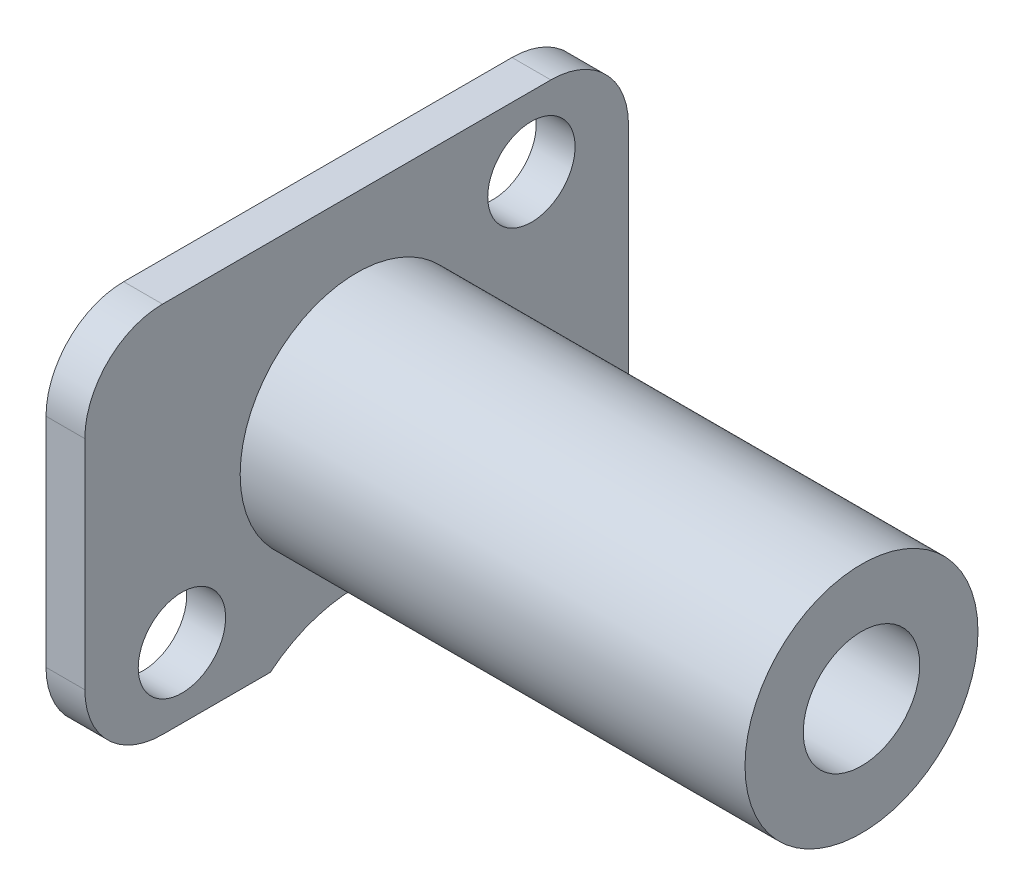
ISO-10303-21;
HEADER;
FILE_DESCRIPTION(('STEP AP214'),'2;1');
FILE_NAME('part.step','',(''),(''),'','','');
FILE_SCHEMA(('AUTOMOTIVE_DESIGN { 1 0 10303 214 1 1 1 1 }'));
ENDSEC;
DATA;
#1=APPLICATION_CONTEXT('core data for automotive mechanical design processes');
#2=APPLICATION_PROTOCOL_DEFINITION('international standard','automotive_design',2000,#1);
#3=PRODUCT_CONTEXT('',#1,'mechanical');
#4=PRODUCT('Part','Part','',(#3));
#5=PRODUCT_RELATED_PRODUCT_CATEGORY('part','',(#4));
#6=PRODUCT_DEFINITION_FORMATION('','',#4);
#7=PRODUCT_DEFINITION_CONTEXT('part definition',#1,'design');
#8=PRODUCT_DEFINITION('design','',#6,#7);
#9=PRODUCT_DEFINITION_SHAPE('','',#8);
#10=(LENGTH_UNIT() NAMED_UNIT(*) SI_UNIT(.MILLI.,.METRE.));
#11=(NAMED_UNIT(*) PLANE_ANGLE_UNIT() SI_UNIT($,.RADIAN.));
#12=(NAMED_UNIT(*) SI_UNIT($,.STERADIAN.) SOLID_ANGLE_UNIT());
#13=UNCERTAINTY_MEASURE_WITH_UNIT(LENGTH_MEASURE(1.E-05),#10,'distance_accuracy_value','');
#14=(GEOMETRIC_REPRESENTATION_CONTEXT(3) GLOBAL_UNCERTAINTY_ASSIGNED_CONTEXT((#13)) GLOBAL_UNIT_ASSIGNED_CONTEXT((#10,
#11,#12)) REPRESENTATION_CONTEXT('',''));
#15=CARTESIAN_POINT('',(0.,0.,0.));
#16=DIRECTION('',(0.,0.,1.));
#17=DIRECTION('',(1.,0.,0.));
#18=AXIS2_PLACEMENT_3D('',#15,#16,#17);
#19=CARTESIAN_POINT('',(0.,0.,0.));
#20=DIRECTION('',(1.,0.,0.));
#21=DIRECTION('',(0.,0.,-1.));
#22=AXIS2_PLACEMENT_3D('',#19,#20,#21);
#23=CYLINDRICAL_SURFACE('',#22,4.7625);
#24=CARTESIAN_POINT('',(16.66875,0.,0.));
#25=DIRECTION('',(1.,0.,0.));
#26=DIRECTION('',(0.,0.,-1.));
#27=AXIS2_PLACEMENT_3D('',#24,#25,#26);
#28=CIRCLE('',#27,4.7625);
#29=CARTESIAN_POINT('',(16.66875,0.,-4.7625));
#30=VERTEX_POINT('',#29);
#31=EDGE_CURVE('E511',#30,#30,#28,.T.);
#32=ORIENTED_EDGE('',*,*,#31,.F.);
#33=EDGE_LOOP('',(#32));
#34=FACE_BOUND('',#33,.T.);
#35=CARTESIAN_POINT('',(-3.96875,0.,0.));
#36=DIRECTION('',(-1.,0.,0.));
#37=DIRECTION('',(0.,0.,1.));
#38=AXIS2_PLACEMENT_3D('',#35,#36,#37);
#39=CIRCLE('',#38,4.7625);
#40=CARTESIAN_POINT('',(-3.96875,0.,4.7625));
#41=VERTEX_POINT('',#40);
#42=EDGE_CURVE('E460',#41,#41,#39,.T.);
#43=ORIENTED_EDGE('',*,*,#42,.F.);
#44=EDGE_LOOP('',(#43));
#45=FACE_BOUND('',#44,.T.);
#46=ADVANCED_FACE('F361',(#34,#45),#23,.T.);
#47=CARTESIAN_POINT('',(-5.55625,4.7625,0.));
#48=DIRECTION('',(-1.,0.,0.));
#49=DIRECTION('',(0.,0.,1.));
#50=AXIS2_PLACEMENT_3D('',#47,#48,#49);
#51=PLANE('',#50);
#52=CARTESIAN_POINT('',(-5.55625,0.,0.));
#53=DIRECTION('',(1.,0.,0.));
#54=DIRECTION('',(0.,0.,-1.));
#55=AXIS2_PLACEMENT_3D('',#52,#53,#54);
#56=CIRCLE('',#55,3.96875);
#57=CARTESIAN_POINT('',(-5.55625,0.,-3.96875));
#58=VERTEX_POINT('',#57);
#59=EDGE_CURVE('E12',#58,#58,#56,.T.);
#60=ORIENTED_EDGE('',*,*,#59,.T.);
#61=EDGE_LOOP('',(#60));
#62=FACE_BOUND('',#61,.T.);
#63=CARTESIAN_POINT('',(-5.55625,-4.7625,7.14375));
#64=DIRECTION('',(-1.,0.,0.));
#65=DIRECTION('',(0.,0.,1.));
#66=AXIS2_PLACEMENT_3D('',#63,#64,#65);
#67=CIRCLE('',#66,1.7859375);
#68=CARTESIAN_POINT('',(-5.55625,-4.7625,8.9296875));
#69=VERTEX_POINT('',#68);
#70=EDGE_CURVE('E649',#69,#69,#67,.T.);
#71=ORIENTED_EDGE('',*,*,#70,.F.);
#72=EDGE_LOOP('',(#71));
#73=FACE_BOUND('',#72,.T.);
#74=CARTESIAN_POINT('',(-5.55625,4.7625,-7.14375));
#75=DIRECTION('',(-1.,0.,0.));
#76=DIRECTION('',(0.,0.,1.));
#77=AXIS2_PLACEMENT_3D('',#74,#75,#76);
#78=CIRCLE('',#77,1.7859375);
#79=CARTESIAN_POINT('',(-5.55625,4.7625,-5.3578125));
#80=VERTEX_POINT('',#79);
#81=EDGE_CURVE('E644',#80,#80,#78,.T.);
#82=ORIENTED_EDGE('',*,*,#81,.F.);
#83=EDGE_LOOP('',(#82));
#84=FACE_BOUND('',#83,.T.);
#85=CARTESIAN_POINT('',(-5.55625,4.445,-7.9375));
#86=DIRECTION('',(-1.,0.,0.));
#87=DIRECTION('',(0.,0.,1.));
#88=AXIS2_PLACEMENT_3D('',#85,#86,#87);
#89=CIRCLE('',#88,3.175);
#90=CARTESIAN_POINT('',(-5.55625,7.62,-7.9375));
#91=VERTEX_POINT('',#90);
#92=CARTESIAN_POINT('',(-5.55625,4.445,-11.1125));
#93=VERTEX_POINT('',#92);
#94=EDGE_CURVE('E441',#91,#93,#89,.T.);
#95=ORIENTED_EDGE('',*,*,#94,.T.);
#96=DIRECTION('',(0.,-1.,0.));
#97=VECTOR('',#96,1.);
#98=CARTESIAN_POINT('',(-5.55625,-4.445,-11.1125));
#99=LINE('',#98,#97);
#100=CARTESIAN_POINT('',(-5.55625,-4.445,-11.1125));
#101=VERTEX_POINT('',#100);
#102=EDGE_CURVE('E451',#93,#101,#99,.T.);
#103=ORIENTED_EDGE('',*,*,#102,.T.);
#104=CARTESIAN_POINT('',(-5.55625,-4.445,-7.9375));
#105=DIRECTION('',(-1.,0.,0.));
#106=DIRECTION('',(0.,0.,1.));
#107=AXIS2_PLACEMENT_3D('',#104,#105,#106);
#108=CIRCLE('',#107,3.175);
#109=CARTESIAN_POINT('',(-5.55625,-7.62,-7.9375));
#110=VERTEX_POINT('',#109);
#111=EDGE_CURVE('E456',#101,#110,#108,.T.);
#112=ORIENTED_EDGE('',*,*,#111,.T.);
#113=DIRECTION('',(0.,0.,1.));
#114=VECTOR('',#113,1.);
#115=CARTESIAN_POINT('',(-5.55625,-7.62,-3.52781792366047));
#116=LINE('',#115,#114);
#117=CARTESIAN_POINT('',(-5.55625,-7.62,-3.52781792366047));
#118=VERTEX_POINT('',#117);
#119=EDGE_CURVE('E468',#110,#118,#116,.T.);
#120=ORIENTED_EDGE('',*,*,#119,.T.);
#121=CARTESIAN_POINT('',(-5.55625,-11.9126,0.));
#122=DIRECTION('',(1.,0.,0.));
#123=DIRECTION('',(0.,0.,1.));
#124=AXIS2_PLACEMENT_3D('',#121,#122,#123);
#125=CIRCLE('',#124,5.55625);
#126=CARTESIAN_POINT('',(-5.55625,-7.62,3.52781792366047));
#127=VERTEX_POINT('',#126);
#128=EDGE_CURVE('E471',#118,#127,#125,.T.);
#129=ORIENTED_EDGE('',*,*,#128,.T.);
#130=DIRECTION('',(0.,0.,1.));
#131=VECTOR('',#130,1.);
#132=CARTESIAN_POINT('',(-5.55625,-7.62,7.9375));
#133=LINE('',#132,#131);
#134=CARTESIAN_POINT('',(-5.55625,-7.62,7.9375));
#135=VERTEX_POINT('',#134);
#136=EDGE_CURVE('E474',#127,#135,#133,.T.);
#137=ORIENTED_EDGE('',*,*,#136,.T.);
#138=CARTESIAN_POINT('',(-5.55625,-4.445,7.9375));
#139=DIRECTION('',(-1.,0.,0.));
#140=DIRECTION('',(0.,0.,-1.));
#141=AXIS2_PLACEMENT_3D('',#138,#139,#140);
#142=CIRCLE('',#141,3.175);
#143=CARTESIAN_POINT('',(-5.55625,-4.445,11.1125));
#144=VERTEX_POINT('',#143);
#145=EDGE_CURVE('E477',#135,#144,#142,.T.);
#146=ORIENTED_EDGE('',*,*,#145,.T.);
#147=DIRECTION('',(0.,1.,0.));
#148=VECTOR('',#147,1.);
#149=CARTESIAN_POINT('',(-5.55625,-4.445,11.1125));
#150=LINE('',#149,#148);
#151=CARTESIAN_POINT('',(-5.55625,4.445,11.1125));
#152=VERTEX_POINT('',#151);
#153=EDGE_CURVE('E480',#144,#152,#150,.T.);
#154=ORIENTED_EDGE('',*,*,#153,.T.);
#155=CARTESIAN_POINT('',(-5.55625,4.445,7.9375));
#156=DIRECTION('',(-1.,0.,0.));
#157=DIRECTION('',(0.,0.,1.));
#158=AXIS2_PLACEMENT_3D('',#155,#156,#157);
#159=CIRCLE('',#158,3.175);
#160=CARTESIAN_POINT('',(-5.55625,7.62,7.9375));
#161=VERTEX_POINT('',#160);
#162=EDGE_CURVE('E483',#152,#161,#159,.T.);
#163=ORIENTED_EDGE('',*,*,#162,.T.);
#164=DIRECTION('',(0.,0.,-1.));
#165=VECTOR('',#164,1.);
#166=CARTESIAN_POINT('',(-5.55625,7.62,7.9375));
#167=LINE('',#166,#165);
#168=EDGE_CURVE('E459',#161,#91,#167,.T.);
#169=ORIENTED_EDGE('',*,*,#168,.T.);
#170=EDGE_LOOP('',(#95,#103,#112,#120,#129,#137,#146,#154,#163,#169));
#171=FACE_BOUND('',#170,.T.);
#172=ADVANCED_FACE('F363',(#62,#73,#84,#171),#51,.T.);
#173=CARTESIAN_POINT('',(0.,0.,0.));
#174=DIRECTION('',(1.,0.,0.));
#175=DIRECTION('',(0.,0.,-1.));
#176=AXIS2_PLACEMENT_3D('',#173,#174,#175);
#177=CYLINDRICAL_SURFACE('',#176,3.96875);
#178=CARTESIAN_POINT('',(0.,0.,0.));
#179=DIRECTION('',(1.,0.,0.));
#180=DIRECTION('',(0.,0.,-1.));
#181=AXIS2_PLACEMENT_3D('',#178,#179,#180);
#182=CIRCLE('',#181,3.96875);
#183=CARTESIAN_POINT('',(0.,0.,-3.96875));
#184=VERTEX_POINT('',#183);
#185=EDGE_CURVE('E369',#184,#184,#182,.T.);
#186=ORIENTED_EDGE('',*,*,#185,.T.);
#187=EDGE_LOOP('',(#186));
#188=FACE_BOUND('',#187,.T.);
#189=ORIENTED_EDGE('',*,*,#59,.F.);
#190=EDGE_LOOP('',(#189));
#191=FACE_BOUND('',#190,.T.);
#192=ADVANCED_FACE('F536',(#188,#191),#177,.F.);
#193=CARTESIAN_POINT('',(0.,3.96875,0.));
#194=DIRECTION('',(-1.,0.,0.));
#195=DIRECTION('',(0.,0.,1.));
#196=AXIS2_PLACEMENT_3D('',#193,#194,#195);
#197=PLANE('',#196);
#198=CARTESIAN_POINT('',(0.,0.,0.));
#199=DIRECTION('',(1.,0.,0.));
#200=DIRECTION('',(0.,0.,-1.));
#201=AXIS2_PLACEMENT_3D('',#198,#199,#200);
#202=CIRCLE('',#201,2.38125);
#203=CARTESIAN_POINT('',(0.,0.,-2.38125));
#204=VERTEX_POINT('',#203);
#205=EDGE_CURVE('E531',#204,#204,#202,.T.);
#206=ORIENTED_EDGE('',*,*,#205,.T.);
#207=EDGE_LOOP('',(#206));
#208=FACE_BOUND('',#207,.T.);
#209=ORIENTED_EDGE('',*,*,#185,.F.);
#210=EDGE_LOOP('',(#209));
#211=FACE_BOUND('',#210,.T.);
#212=ADVANCED_FACE('F539',(#208,#211),#197,.T.);
#213=CARTESIAN_POINT('',(0.,0.,0.));
#214=DIRECTION('',(1.,0.,0.));
#215=DIRECTION('',(0.,0.,-1.));
#216=AXIS2_PLACEMENT_3D('',#213,#214,#215);
#217=CYLINDRICAL_SURFACE('',#216,2.38125);
#218=CARTESIAN_POINT('',(16.66875,0.,0.));
#219=DIRECTION('',(1.,0.,0.));
#220=DIRECTION('',(0.,0.,-1.));
#221=AXIS2_PLACEMENT_3D('',#218,#219,#220);
#222=CIRCLE('',#221,2.38125);
#223=CARTESIAN_POINT('',(16.66875,0.,-2.38125));
#224=VERTEX_POINT('',#223);
#225=EDGE_CURVE('E528',#224,#224,#222,.T.);
#226=ORIENTED_EDGE('',*,*,#225,.T.);
#227=EDGE_LOOP('',(#226));
#228=FACE_BOUND('',#227,.T.);
#229=ORIENTED_EDGE('',*,*,#205,.F.);
#230=EDGE_LOOP('',(#229));
#231=FACE_BOUND('',#230,.T.);
#232=ADVANCED_FACE('F541',(#228,#231),#217,.F.);
#233=CARTESIAN_POINT('',(16.66875,4.7625,0.));
#234=DIRECTION('',(1.,0.,0.));
#235=DIRECTION('',(0.,0.,-1.));
#236=AXIS2_PLACEMENT_3D('',#233,#234,#235);
#237=PLANE('',#236);
#238=ORIENTED_EDGE('',*,*,#31,.T.);
#239=EDGE_LOOP('',(#238));
#240=FACE_BOUND('',#239,.T.);
#241=ORIENTED_EDGE('',*,*,#225,.F.);
#242=EDGE_LOOP('',(#241));
#243=FACE_BOUND('',#242,.T.);
#244=ADVANCED_FACE('F548',(#240,#243),#237,.T.);
#245=CARTESIAN_POINT('',(-3.96875,4.445,-7.9375));
#246=DIRECTION('',(-1.,0.,0.));
#247=DIRECTION('',(0.,0.,1.));
#248=AXIS2_PLACEMENT_3D('',#245,#246,#247);
#249=CYLINDRICAL_SURFACE('',#248,3.175);
#250=ORIENTED_EDGE('',*,*,#94,.F.);
#251=DIRECTION('',(-1.,0.,0.));
#252=VECTOR('',#251,1.);
#253=CARTESIAN_POINT('',(-3.96875,7.62,-7.9375));
#254=LINE('',#253,#252);
#255=CARTESIAN_POINT('',(-3.96875,7.62,-7.9375));
#256=VERTEX_POINT('',#255);
#257=EDGE_CURVE('E376',#256,#91,#254,.T.);
#258=ORIENTED_EDGE('',*,*,#257,.F.);
#259=CARTESIAN_POINT('',(-3.96875,4.445,-7.9375));
#260=DIRECTION('',(-1.,0.,0.));
#261=DIRECTION('',(0.,0.,1.));
#262=AXIS2_PLACEMENT_3D('',#259,#260,#261);
#263=CIRCLE('',#262,3.175);
#264=CARTESIAN_POINT('',(-3.96875,4.445,-11.1125));
#265=VERTEX_POINT('',#264);
#266=EDGE_CURVE('E443',#256,#265,#263,.T.);
#267=ORIENTED_EDGE('',*,*,#266,.T.);
#268=DIRECTION('',(-1.,0.,0.));
#269=VECTOR('',#268,1.);
#270=CARTESIAN_POINT('',(-3.96875,4.445,-11.1125));
#271=LINE('',#270,#269);
#272=EDGE_CURVE('E437',#265,#93,#271,.T.);
#273=ORIENTED_EDGE('',*,*,#272,.T.);
#274=EDGE_LOOP('',(#250,#258,#267,#273));
#275=FACE_BOUND('',#274,.T.);
#276=ADVANCED_FACE('F439',(#275),#249,.T.);
#277=CARTESIAN_POINT('',(-3.96875,7.62,7.9375));
#278=DIRECTION('',(0.,1.,0.));
#279=DIRECTION('',(0.,0.,1.));
#280=AXIS2_PLACEMENT_3D('',#277,#278,#279);
#281=PLANE('',#280);
#282=ORIENTED_EDGE('',*,*,#168,.F.);
#283=DIRECTION('',(-1.,0.,0.));
#284=VECTOR('',#283,1.);
#285=CARTESIAN_POINT('',(-3.96875,7.62,7.9375));
#286=LINE('',#285,#284);
#287=CARTESIAN_POINT('',(-3.96875,7.62,7.9375));
#288=VERTEX_POINT('',#287);
#289=EDGE_CURVE('E384',#288,#161,#286,.T.);
#290=ORIENTED_EDGE('',*,*,#289,.F.);
#291=DIRECTION('',(0.,0.,-1.));
#292=VECTOR('',#291,1.);
#293=CARTESIAN_POINT('',(-3.96875,7.62,7.9375));
#294=LINE('',#293,#292);
#295=EDGE_CURVE('E448',#288,#256,#294,.T.);
#296=ORIENTED_EDGE('',*,*,#295,.T.);
#297=ORIENTED_EDGE('',*,*,#257,.T.);
#298=EDGE_LOOP('',(#282,#290,#296,#297));
#299=FACE_BOUND('',#298,.T.);
#300=ADVANCED_FACE('F568',(#299),#281,.T.);
#301=CARTESIAN_POINT('',(-3.96875,4.445,7.9375));
#302=DIRECTION('',(-1.,0.,0.));
#303=DIRECTION('',(0.,0.,1.));
#304=AXIS2_PLACEMENT_3D('',#301,#302,#303);
#305=CYLINDRICAL_SURFACE('',#304,3.175);
#306=ORIENTED_EDGE('',*,*,#162,.F.);
#307=DIRECTION('',(-1.,0.,0.));
#308=VECTOR('',#307,1.);
#309=CARTESIAN_POINT('',(-3.96875,4.445,11.1125));
#310=LINE('',#309,#308);
#311=CARTESIAN_POINT('',(-3.96875,4.445,11.1125));
#312=VERTEX_POINT('',#311);
#313=EDGE_CURVE('E513',#312,#152,#310,.T.);
#314=ORIENTED_EDGE('',*,*,#313,.F.);
#315=CARTESIAN_POINT('',(-3.96875,4.445,7.9375));
#316=DIRECTION('',(-1.,0.,0.));
#317=DIRECTION('',(0.,0.,1.));
#318=AXIS2_PLACEMENT_3D('',#315,#316,#317);
#319=CIRCLE('',#318,3.175);
#320=EDGE_CURVE('E507',#312,#288,#319,.T.);
#321=ORIENTED_EDGE('',*,*,#320,.T.);
#322=ORIENTED_EDGE('',*,*,#289,.T.);
#323=EDGE_LOOP('',(#306,#314,#321,#322));
#324=FACE_BOUND('',#323,.T.);
#325=ADVANCED_FACE('F576',(#324),#305,.T.);
#326=CARTESIAN_POINT('',(-3.96875,-4.445,11.1125));
#327=DIRECTION('',(0.,0.,1.));
#328=DIRECTION('',(0.,-1.,0.));
#329=AXIS2_PLACEMENT_3D('',#326,#327,#328);
#330=PLANE('',#329);
#331=ORIENTED_EDGE('',*,*,#153,.F.);
#332=DIRECTION('',(-1.,0.,0.));
#333=VECTOR('',#332,1.);
#334=CARTESIAN_POINT('',(-3.96875,-4.445,11.1125));
#335=LINE('',#334,#333);
#336=CARTESIAN_POINT('',(-3.96875,-4.445,11.1125));
#337=VERTEX_POINT('',#336);
#338=EDGE_CURVE('E515',#337,#144,#335,.T.);
#339=ORIENTED_EDGE('',*,*,#338,.F.);
#340=DIRECTION('',(0.,1.,0.));
#341=VECTOR('',#340,1.);
#342=CARTESIAN_POINT('',(-3.96875,-4.445,11.1125));
#343=LINE('',#342,#341);
#344=EDGE_CURVE('E504',#337,#312,#343,.T.);
#345=ORIENTED_EDGE('',*,*,#344,.T.);
#346=ORIENTED_EDGE('',*,*,#313,.T.);
#347=EDGE_LOOP('',(#331,#339,#345,#346));
#348=FACE_BOUND('',#347,.T.);
#349=ADVANCED_FACE('F581',(#348),#330,.T.);
#350=CARTESIAN_POINT('',(-3.96875,-4.445,7.9375));
#351=DIRECTION('',(-1.,0.,0.));
#352=DIRECTION('',(0.,0.,1.));
#353=AXIS2_PLACEMENT_3D('',#350,#351,#352);
#354=CYLINDRICAL_SURFACE('',#353,3.175);
#355=ORIENTED_EDGE('',*,*,#145,.F.);
#356=DIRECTION('',(-1.,0.,0.));
#357=VECTOR('',#356,1.);
#358=CARTESIAN_POINT('',(-3.96875,-7.62,7.9375));
#359=LINE('',#358,#357);
#360=CARTESIAN_POINT('',(-3.96875,-7.62,7.9375));
#361=VERTEX_POINT('',#360);
#362=EDGE_CURVE('E517',#361,#135,#359,.T.);
#363=ORIENTED_EDGE('',*,*,#362,.F.);
#364=CARTESIAN_POINT('',(-3.96875,-4.445,7.9375));
#365=DIRECTION('',(-1.,0.,0.));
#366=DIRECTION('',(0.,0.,-1.));
#367=AXIS2_PLACEMENT_3D('',#364,#365,#366);
#368=CIRCLE('',#367,3.175);
#369=EDGE_CURVE('E501',#361,#337,#368,.T.);
#370=ORIENTED_EDGE('',*,*,#369,.T.);
#371=ORIENTED_EDGE('',*,*,#338,.T.);
#372=EDGE_LOOP('',(#355,#363,#370,#371));
#373=FACE_BOUND('',#372,.T.);
#374=ADVANCED_FACE('F590',(#373),#354,.T.);
#375=CARTESIAN_POINT('',(-3.96875,-7.62,7.9375));
#376=DIRECTION('',(0.,-1.,0.));
#377=DIRECTION('',(0.,0.,-1.));
#378=AXIS2_PLACEMENT_3D('',#375,#376,#377);
#379=PLANE('',#378);
#380=ORIENTED_EDGE('',*,*,#136,.F.);
#381=DIRECTION('',(-1.,0.,0.));
#382=VECTOR('',#381,1.);
#383=CARTESIAN_POINT('',(-3.96875,-7.62,3.52781792366047));
#384=LINE('',#383,#382);
#385=CARTESIAN_POINT('',(-3.96875,-7.62,3.52781792366047));
#386=VERTEX_POINT('',#385);
#387=EDGE_CURVE('E519',#386,#127,#384,.T.);
#388=ORIENTED_EDGE('',*,*,#387,.F.);
#389=DIRECTION('',(0.,0.,1.));
#390=VECTOR('',#389,1.);
#391=CARTESIAN_POINT('',(-3.96875,-7.62,7.9375));
#392=LINE('',#391,#390);
#393=EDGE_CURVE('E498',#386,#361,#392,.T.);
#394=ORIENTED_EDGE('',*,*,#393,.T.);
#395=ORIENTED_EDGE('',*,*,#362,.T.);
#396=EDGE_LOOP('',(#380,#388,#394,#395));
#397=FACE_BOUND('',#396,.T.);
#398=ADVANCED_FACE('F594',(#397),#379,.T.);
#399=CARTESIAN_POINT('',(-3.96875,-11.9126,0.));
#400=DIRECTION('',(-1.,0.,0.));
#401=DIRECTION('',(0.,0.,1.));
#402=AXIS2_PLACEMENT_3D('',#399,#400,#401);
#403=CYLINDRICAL_SURFACE('',#402,5.55625);
#404=ORIENTED_EDGE('',*,*,#128,.F.);
#405=DIRECTION('',(-1.,0.,0.));
#406=VECTOR('',#405,1.);
#407=CARTESIAN_POINT('',(-3.96875,-7.62,-3.52781792366047));
#408=LINE('',#407,#406);
#409=CARTESIAN_POINT('',(-3.96875,-7.62,-3.52781792366047));
#410=VERTEX_POINT('',#409);
#411=EDGE_CURVE('E521',#410,#118,#408,.T.);
#412=ORIENTED_EDGE('',*,*,#411,.F.);
#413=CARTESIAN_POINT('',(-3.96875,-11.9126,0.));
#414=DIRECTION('',(1.,0.,0.));
#415=DIRECTION('',(0.,0.,1.));
#416=AXIS2_PLACEMENT_3D('',#413,#414,#415);
#417=CIRCLE('',#416,5.55625);
#418=EDGE_CURVE('E495',#410,#386,#417,.T.);
#419=ORIENTED_EDGE('',*,*,#418,.T.);
#420=ORIENTED_EDGE('',*,*,#387,.T.);
#421=EDGE_LOOP('',(#404,#412,#419,#420));
#422=FACE_BOUND('',#421,.T.);
#423=ADVANCED_FACE('F598',(#422),#403,.F.);
#424=CARTESIAN_POINT('',(-3.96875,-7.62,-3.52781792366047));
#425=DIRECTION('',(0.,-1.,0.));
#426=DIRECTION('',(0.,0.,-1.));
#427=AXIS2_PLACEMENT_3D('',#424,#425,#426);
#428=PLANE('',#427);
#429=ORIENTED_EDGE('',*,*,#119,.F.);
#430=DIRECTION('',(-1.,0.,0.));
#431=VECTOR('',#430,1.);
#432=CARTESIAN_POINT('',(-3.96875,-7.62,-7.9375));
#433=LINE('',#432,#431);
#434=CARTESIAN_POINT('',(-3.96875,-7.62,-7.9375));
#435=VERTEX_POINT('',#434);
#436=EDGE_CURVE('E523',#435,#110,#433,.T.);
#437=ORIENTED_EDGE('',*,*,#436,.F.);
#438=DIRECTION('',(0.,0.,1.));
#439=VECTOR('',#438,1.);
#440=CARTESIAN_POINT('',(-3.96875,-7.62,-3.52781792366047));
#441=LINE('',#440,#439);
#442=EDGE_CURVE('E492',#435,#410,#441,.T.);
#443=ORIENTED_EDGE('',*,*,#442,.T.);
#444=ORIENTED_EDGE('',*,*,#411,.T.);
#445=EDGE_LOOP('',(#429,#437,#443,#444));
#446=FACE_BOUND('',#445,.T.);
#447=ADVANCED_FACE('F602',(#446),#428,.T.);
#448=CARTESIAN_POINT('',(-3.96875,-4.445,-7.9375));
#449=DIRECTION('',(-1.,0.,0.));
#450=DIRECTION('',(0.,0.,1.));
#451=AXIS2_PLACEMENT_3D('',#448,#449,#450);
#452=CYLINDRICAL_SURFACE('',#451,3.175);
#453=ORIENTED_EDGE('',*,*,#111,.F.);
#454=DIRECTION('',(-1.,0.,0.));
#455=VECTOR('',#454,1.);
#456=CARTESIAN_POINT('',(-3.96875,-4.445,-11.1125));
#457=LINE('',#456,#455);
#458=CARTESIAN_POINT('',(-3.96875,-4.445,-11.1125));
#459=VERTEX_POINT('',#458);
#460=EDGE_CURVE('E447',#459,#101,#457,.T.);
#461=ORIENTED_EDGE('',*,*,#460,.F.);
#462=CARTESIAN_POINT('',(-3.96875,-4.445,-7.9375));
#463=DIRECTION('',(-1.,0.,0.));
#464=DIRECTION('',(0.,0.,1.));
#465=AXIS2_PLACEMENT_3D('',#462,#463,#464);
#466=CIRCLE('',#465,3.175);
#467=EDGE_CURVE('E489',#459,#435,#466,.T.);
#468=ORIENTED_EDGE('',*,*,#467,.T.);
#469=ORIENTED_EDGE('',*,*,#436,.T.);
#470=EDGE_LOOP('',(#453,#461,#468,#469));
#471=FACE_BOUND('',#470,.T.);
#472=ADVANCED_FACE('F606',(#471),#452,.T.);
#473=CARTESIAN_POINT('',(-3.96875,-4.445,-11.1125));
#474=DIRECTION('',(0.,0.,-1.));
#475=DIRECTION('',(0.,1.,0.));
#476=AXIS2_PLACEMENT_3D('',#473,#474,#475);
#477=PLANE('',#476);
#478=ORIENTED_EDGE('',*,*,#102,.F.);
#479=ORIENTED_EDGE('',*,*,#272,.F.);
#480=DIRECTION('',(0.,-1.,0.));
#481=VECTOR('',#480,1.);
#482=CARTESIAN_POINT('',(-3.96875,-4.445,-11.1125));
#483=LINE('',#482,#481);
#484=EDGE_CURVE('E487',#265,#459,#483,.T.);
#485=ORIENTED_EDGE('',*,*,#484,.T.);
#486=ORIENTED_EDGE('',*,*,#460,.T.);
#487=EDGE_LOOP('',(#478,#479,#485,#486));
#488=FACE_BOUND('',#487,.T.);
#489=ADVANCED_FACE('F452',(#488),#477,.T.);
#490=CARTESIAN_POINT('',(-3.96875,4.445,-7.9375));
#491=DIRECTION('',(-1.,0.,0.));
#492=DIRECTION('',(0.,0.,1.));
#493=AXIS2_PLACEMENT_3D('',#490,#491,#492);
#494=PLANE('',#493);
#495=CARTESIAN_POINT('',(-3.96875,-4.7625,7.14375));
#496=DIRECTION('',(-1.,0.,0.));
#497=DIRECTION('',(0.,0.,1.));
#498=AXIS2_PLACEMENT_3D('',#495,#496,#497);
#499=CIRCLE('',#498,1.7859375);
#500=CARTESIAN_POINT('',(-3.96875,-4.7625,8.9296875));
#501=VERTEX_POINT('',#500);
#502=EDGE_CURVE('E624',#501,#501,#499,.T.);
#503=ORIENTED_EDGE('',*,*,#502,.T.);
#504=EDGE_LOOP('',(#503));
#505=FACE_BOUND('',#504,.T.);
#506=CARTESIAN_POINT('',(-3.96875,4.7625,-7.14375));
#507=DIRECTION('',(-1.,0.,0.));
#508=DIRECTION('',(0.,0.,1.));
#509=AXIS2_PLACEMENT_3D('',#506,#507,#508);
#510=CIRCLE('',#509,1.7859375);
#511=CARTESIAN_POINT('',(-3.96875,4.7625,-5.3578125));
#512=VERTEX_POINT('',#511);
#513=EDGE_CURVE('E463',#512,#512,#510,.T.);
#514=ORIENTED_EDGE('',*,*,#513,.T.);
#515=EDGE_LOOP('',(#514));
#516=FACE_BOUND('',#515,.T.);
#517=ORIENTED_EDGE('',*,*,#42,.T.);
#518=EDGE_LOOP('',(#517));
#519=FACE_BOUND('',#518,.T.);
#520=ORIENTED_EDGE('',*,*,#266,.F.);
#521=ORIENTED_EDGE('',*,*,#295,.F.);
#522=ORIENTED_EDGE('',*,*,#320,.F.);
#523=ORIENTED_EDGE('',*,*,#344,.F.);
#524=ORIENTED_EDGE('',*,*,#369,.F.);
#525=ORIENTED_EDGE('',*,*,#393,.F.);
#526=ORIENTED_EDGE('',*,*,#418,.F.);
#527=ORIENTED_EDGE('',*,*,#442,.F.);
#528=ORIENTED_EDGE('',*,*,#467,.F.);
#529=ORIENTED_EDGE('',*,*,#484,.F.);
#530=EDGE_LOOP('',(#520,#521,#522,#523,#524,#525,#526,#527,#528,#529));
#531=FACE_BOUND('',#530,.T.);
#532=ADVANCED_FACE('F585',(#505,#516,#519,#531),#494,.F.);
#533=CARTESIAN_POINT('',(-3.96875,4.7625,-7.14375));
#534=DIRECTION('',(-1.,0.,0.));
#535=DIRECTION('',(0.,0.,1.));
#536=AXIS2_PLACEMENT_3D('',#533,#534,#535);
#537=CYLINDRICAL_SURFACE('',#536,1.7859375);
#538=ORIENTED_EDGE('',*,*,#513,.F.);
#539=EDGE_LOOP('',(#538));
#540=FACE_BOUND('',#539,.T.);
#541=ORIENTED_EDGE('',*,*,#81,.T.);
#542=EDGE_LOOP('',(#541));
#543=FACE_BOUND('',#542,.T.);
#544=ADVANCED_FACE('F614',(#540,#543),#537,.F.);
#545=CARTESIAN_POINT('',(-3.96875,-4.7625,7.14375));
#546=DIRECTION('',(-1.,0.,0.));
#547=DIRECTION('',(0.,0.,1.));
#548=AXIS2_PLACEMENT_3D('',#545,#546,#547);
#549=CYLINDRICAL_SURFACE('',#548,1.7859375);
#550=ORIENTED_EDGE('',*,*,#502,.F.);
#551=EDGE_LOOP('',(#550));
#552=FACE_BOUND('',#551,.T.);
#553=ORIENTED_EDGE('',*,*,#70,.T.);
#554=EDGE_LOOP('',(#553));
#555=FACE_BOUND('',#554,.T.);
#556=ADVANCED_FACE('F619',(#552,#555),#549,.F.);
#557=CLOSED_SHELL('',(#46,#172,#192,#212,#232,#244,#276,#300,#325,#349,#374,#398,#423,#447,#472,
#489,#532,#544,#556));
#558=MANIFOLD_SOLID_BREP('B2',#557);
#559=ADVANCED_BREP_SHAPE_REPRESENTATION('',(#18,#558),#14);
#560=SHAPE_DEFINITION_REPRESENTATION(#9,#559);
ENDSEC;
END-ISO-10303-21;
